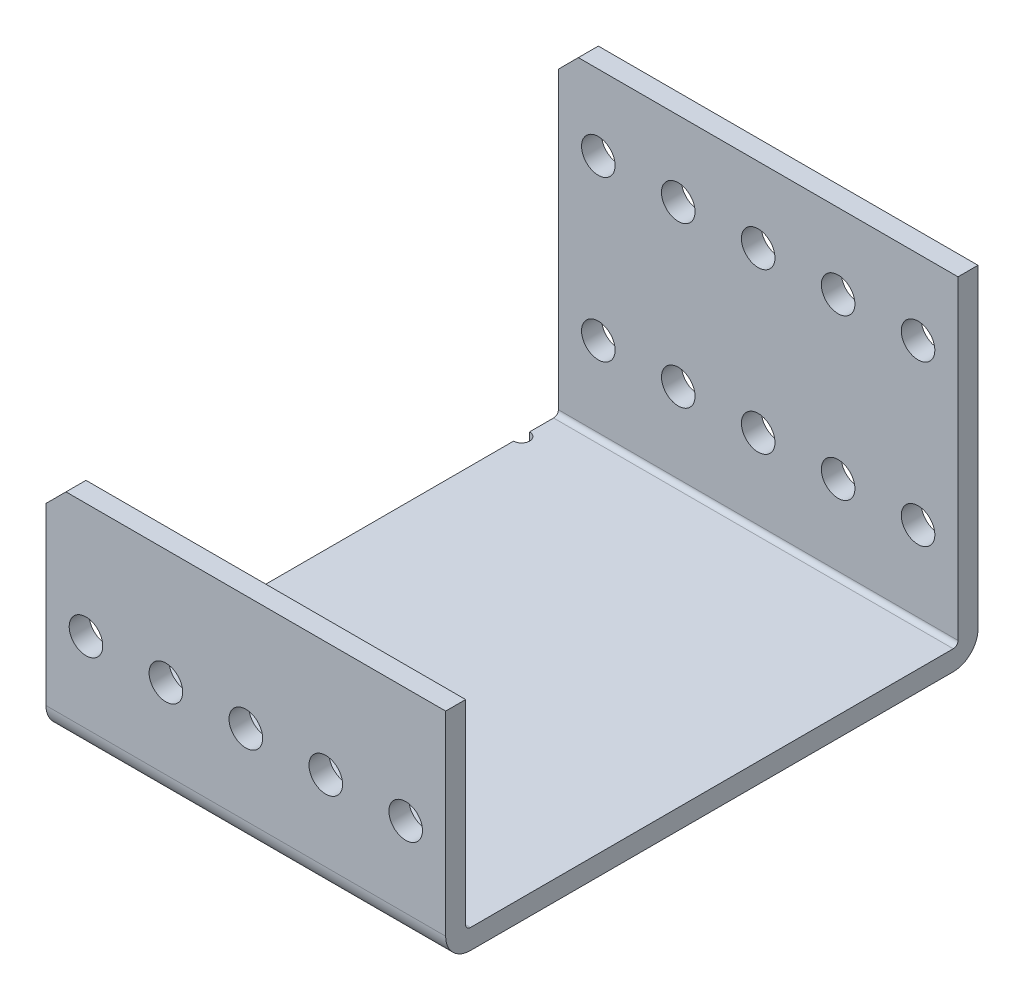
ISO-10303-21;
HEADER;
FILE_DESCRIPTION(('STEP AP214'),'2;1');
FILE_NAME('part.step','',(''),(''),'','','');
FILE_SCHEMA(('AUTOMOTIVE_DESIGN { 1 0 10303 214 1 1 1 1 }'));
ENDSEC;
DATA;
#1=APPLICATION_CONTEXT('core data for automotive mechanical design processes');
#2=APPLICATION_PROTOCOL_DEFINITION('international standard','automotive_design',2000,#1);
#3=PRODUCT_CONTEXT('',#1,'mechanical');
#4=PRODUCT('Part','Part','',(#3));
#5=PRODUCT_RELATED_PRODUCT_CATEGORY('part','',(#4));
#6=PRODUCT_DEFINITION_FORMATION('','',#4);
#7=PRODUCT_DEFINITION_CONTEXT('part definition',#1,'design');
#8=PRODUCT_DEFINITION('design','',#6,#7);
#9=PRODUCT_DEFINITION_SHAPE('','',#8);
#10=(LENGTH_UNIT() NAMED_UNIT(*) SI_UNIT(.MILLI.,.METRE.));
#11=(NAMED_UNIT(*) PLANE_ANGLE_UNIT() SI_UNIT($,.RADIAN.));
#12=(NAMED_UNIT(*) SI_UNIT($,.STERADIAN.) SOLID_ANGLE_UNIT());
#13=UNCERTAINTY_MEASURE_WITH_UNIT(LENGTH_MEASURE(1.E-05),#10,'distance_accuracy_value','');
#14=(GEOMETRIC_REPRESENTATION_CONTEXT(3) GLOBAL_UNCERTAINTY_ASSIGNED_CONTEXT((#13)) GLOBAL_UNIT_ASSIGNED_CONTEXT((#10,
#11,#12)) REPRESENTATION_CONTEXT('',''));
#15=CARTESIAN_POINT('',(0.,0.,0.));
#16=DIRECTION('',(0.,0.,1.));
#17=DIRECTION('',(1.,0.,0.));
#18=AXIS2_PLACEMENT_3D('',#15,#16,#17);
#19=CARTESIAN_POINT('',(-96.1019685333978,22.8913980391147,145.560491578575));
#20=DIRECTION('',(0.,0.,1.));
#21=DIRECTION('',(1.,0.,0.));
#22=AXIS2_PLACEMENT_3D('',#19,#20,#21);
#23=PLANE('',#22);
#24=DIRECTION('',(0.,1.,0.));
#25=VECTOR('',#24,1.);
#26=CARTESIAN_POINT('',(-32.6019685333979,170.358822857148,145.560491578576));
#27=LINE('',#26,#25);
#28=CARTESIAN_POINT('',(-32.6019685333979,26.8283980391147,145.560491578576));
#29=VERTEX_POINT('',#28);
#30=CARTESIAN_POINT('',(-32.6019685333979,57.8163980391021,145.560491578576));
#31=VERTEX_POINT('',#30);
#32=EDGE_CURVE('E209',#29,#31,#27,.T.);
#33=ORIENTED_EDGE('',*,*,#32,.T.);
#34=DIRECTION('',(1.,0.,0.));
#35=VECTOR('',#34,1.);
#36=CARTESIAN_POINT('',(-96.1019685333978,57.8163980391021,145.560491578575));
#37=LINE('',#36,#35);
#38=CARTESIAN_POINT('',(-92.9269685333979,57.8163980391021,145.560491578575));
#39=VERTEX_POINT('',#38);
#40=EDGE_CURVE('E329',#39,#31,#37,.T.);
#41=ORIENTED_EDGE('',*,*,#40,.F.);
#42=DIRECTION('',(0.707106781186535,0.70710678118656,0.));
#43=VECTOR('',#42,1.);
#44=CARTESIAN_POINT('',(-111.976968533392,38.7663980391078,145.560491578575));
#45=LINE('',#44,#43);
#46=CARTESIAN_POINT('',(-96.1019685333978,54.6413980391021,145.560491578575));
#47=VERTEX_POINT('',#46);
#48=EDGE_CURVE('E261',#39,#47,#45,.F.);
#49=ORIENTED_EDGE('',*,*,#48,.T.);
#50=DIRECTION('',(0.,1.,0.));
#51=VECTOR('',#50,1.);
#52=CARTESIAN_POINT('',(-96.1019685333978,22.8913980391147,145.560491578575));
#53=LINE('',#52,#51);
#54=CARTESIAN_POINT('',(-96.1019685333978,26.8283980391147,145.560491578575));
#55=VERTEX_POINT('',#54);
#56=EDGE_CURVE('E322',#55,#47,#53,.T.);
#57=ORIENTED_EDGE('',*,*,#56,.F.);
#58=DIRECTION('',(1.,0.,0.));
#59=VECTOR('',#58,1.);
#60=CARTESIAN_POINT('',(602.398031466602,26.8283980391147,145.560491578575));
#61=LINE('',#60,#59);
#62=EDGE_CURVE('E227',#55,#29,#61,.T.);
#63=ORIENTED_EDGE('',*,*,#62,.T.);
#64=EDGE_LOOP('',(#33,#41,#49,#57,#63));
#65=FACE_BOUND('',#64,.T.);
#66=CARTESIAN_POINT('',(-89.7519685333979,39.5283980391153,145.560491578576));
#67=DIRECTION('',(0.,0.,-1.));
#68=DIRECTION('',(-1.,0.,0.));
#69=AXIS2_PLACEMENT_3D('',#66,#67,#68);
#70=CIRCLE('',#69,2.667);
#71=CARTESIAN_POINT('',(-92.4189685333979,39.5283980391153,145.560491578576));
#72=VERTEX_POINT('',#71);
#73=EDGE_CURVE('E309',#72,#72,#70,.T.);
#74=ORIENTED_EDGE('',*,*,#73,.T.);
#75=EDGE_LOOP('',(#74));
#76=FACE_BOUND('',#75,.T.);
#77=CARTESIAN_POINT('',(-77.0519685333979,39.5283980391153,145.560491578576));
#78=DIRECTION('',(0.,0.,-1.));
#79=DIRECTION('',(-1.,0.,0.));
#80=AXIS2_PLACEMENT_3D('',#77,#78,#79);
#81=CIRCLE('',#80,2.667);
#82=CARTESIAN_POINT('',(-79.7189685333979,39.5283980391153,145.560491578576));
#83=VERTEX_POINT('',#82);
#84=EDGE_CURVE('E303',#83,#83,#81,.T.);
#85=ORIENTED_EDGE('',*,*,#84,.T.);
#86=EDGE_LOOP('',(#85));
#87=FACE_BOUND('',#86,.T.);
#88=CARTESIAN_POINT('',(-64.351968533398,39.5283980391153,145.560491578576));
#89=DIRECTION('',(0.,0.,-1.));
#90=DIRECTION('',(-1.,0.,0.));
#91=AXIS2_PLACEMENT_3D('',#88,#89,#90);
#92=CIRCLE('',#91,2.667);
#93=CARTESIAN_POINT('',(-67.018968533398,39.5283980391153,145.560491578576));
#94=VERTEX_POINT('',#93);
#95=EDGE_CURVE('E297',#94,#94,#92,.T.);
#96=ORIENTED_EDGE('',*,*,#95,.T.);
#97=EDGE_LOOP('',(#96));
#98=FACE_BOUND('',#97,.T.);
#99=CARTESIAN_POINT('',(-51.6519685333979,39.5283980391153,145.560491578576));
#100=DIRECTION('',(0.,0.,-1.));
#101=DIRECTION('',(-1.,0.,0.));
#102=AXIS2_PLACEMENT_3D('',#99,#100,#101);
#103=CIRCLE('',#102,2.667);
#104=CARTESIAN_POINT('',(-54.3189685333979,39.5283980391153,145.560491578576));
#105=VERTEX_POINT('',#104);
#106=EDGE_CURVE('E291',#105,#105,#103,.T.);
#107=ORIENTED_EDGE('',*,*,#106,.T.);
#108=EDGE_LOOP('',(#107));
#109=FACE_BOUND('',#108,.T.);
#110=CARTESIAN_POINT('',(-38.9519685333979,39.5283980391153,145.560491578576));
#111=DIRECTION('',(0.,0.,-1.));
#112=DIRECTION('',(-1.,0.,0.));
#113=AXIS2_PLACEMENT_3D('',#110,#111,#112);
#114=CIRCLE('',#113,2.667);
#115=CARTESIAN_POINT('',(-41.6189685333979,39.5283980391153,145.560491578576));
#116=VERTEX_POINT('',#115);
#117=EDGE_CURVE('E285',#116,#116,#114,.T.);
#118=ORIENTED_EDGE('',*,*,#117,.T.);
#119=EDGE_LOOP('',(#118));
#120=FACE_BOUND('',#119,.T.);
#121=ADVANCED_FACE('F38',(#65,#76,#87,#98,#109,#120),#23,.T.);
#122=CARTESIAN_POINT('',(-96.101968533398,22.8913980391147,60.9784915785786));
#123=DIRECTION('',(-1.,0.,0.));
#124=DIRECTION('',(0.,0.,1.));
#125=AXIS2_PLACEMENT_3D('',#122,#123,#124);
#126=PLANE('',#125);
#127=DIRECTION('',(0.,0.,1.));
#128=VECTOR('',#127,1.);
#129=CARTESIAN_POINT('',(-96.101968533398,22.8913980391147,60.9784915785786));
#130=LINE('',#129,#128);
#131=CARTESIAN_POINT('',(-96.1019685333979,22.8913980391147,137.813491578575));
#132=VERTEX_POINT('',#131);
#133=CARTESIAN_POINT('',(-96.1019685333978,22.8913980391147,141.623491578575));
#134=VERTEX_POINT('',#133);
#135=EDGE_CURVE('E333',#132,#134,#130,.T.);
#136=ORIENTED_EDGE('',*,*,#135,.T.);
#137=CARTESIAN_POINT('',(-96.1019685333978,26.8283980391147,141.623491578575));
#138=DIRECTION('',(-1.,0.,0.));
#139=DIRECTION('',(0.,0.,1.));
#140=AXIS2_PLACEMENT_3D('',#137,#138,#139);
#141=CIRCLE('',#140,3.937);
#142=EDGE_CURVE('E213',#134,#55,#141,.T.);
#143=ORIENTED_EDGE('',*,*,#142,.T.);
#144=ORIENTED_EDGE('',*,*,#56,.T.);
#145=DIRECTION('',(0.,0.,-1.));
#146=VECTOR('',#145,1.);
#147=CARTESIAN_POINT('',(-96.101968533398,54.6413980391021,60.9784915785786));
#148=LINE('',#147,#146);
#149=CARTESIAN_POINT('',(-96.1019685333979,54.6413980391021,142.385491578578));
#150=VERTEX_POINT('',#149);
#151=EDGE_CURVE('E258',#47,#150,#148,.T.);
#152=ORIENTED_EDGE('',*,*,#151,.T.);
#153=DIRECTION('',(0.,-1.,0.));
#154=VECTOR('',#153,1.);
#155=CARTESIAN_POINT('',(-96.1019685333979,57.8163980391014,142.385491578578));
#156=LINE('',#155,#154);
#157=CARTESIAN_POINT('',(-96.1019685333979,26.828398039114,142.385491578578));
#158=VERTEX_POINT('',#157);
#159=EDGE_CURVE('E346',#150,#158,#156,.T.);
#160=ORIENTED_EDGE('',*,*,#159,.T.);
#161=CARTESIAN_POINT('',(-96.1019685333978,26.828398039114,141.623491578578));
#162=DIRECTION('',(-1.,0.,0.));
#163=DIRECTION('',(0.,0.,1.));
#164=AXIS2_PLACEMENT_3D('',#161,#162,#163);
#165=CIRCLE('',#164,0.761999999999985);
#166=CARTESIAN_POINT('',(-96.1019685333979,26.066398039114,141.623491578578));
#167=VERTEX_POINT('',#166);
#168=EDGE_CURVE('E231',#158,#167,#165,.F.);
#169=ORIENTED_EDGE('',*,*,#168,.T.);
#170=DIRECTION('',(0.,0.,-1.));
#171=VECTOR('',#170,1.);
#172=CARTESIAN_POINT('',(-96.1019685333979,26.066398039114,142.385491578578));
#173=LINE('',#172,#171);
#174=CARTESIAN_POINT('',(-96.1019685333979,26.066398039114,137.813491578575));
#175=VERTEX_POINT('',#174);
#176=EDGE_CURVE('E341',#167,#175,#173,.T.);
#177=ORIENTED_EDGE('',*,*,#176,.T.);
#178=DIRECTION('',(0.,1.,0.));
#179=VECTOR('',#178,1.);
#180=CARTESIAN_POINT('',(-96.1019685333979,26.066398039114,137.813491578575));
#181=LINE('',#180,#179);
#182=EDGE_CURVE('E367',#132,#175,#181,.T.);
#183=ORIENTED_EDGE('',*,*,#182,.F.);
#184=EDGE_LOOP('',(#136,#143,#144,#152,#160,#169,#177,#183));
#185=FACE_BOUND('',#184,.T.);
#186=ADVANCED_FACE('F549',(#185),#126,.T.);
#187=DIRECTION('',(0.,1.,0.));
#188=VECTOR('',#187,1.);
#189=CARTESIAN_POINT('',(-96.1019685333979,26.066398039114,135.273491578575));
#190=LINE('',#189,#188);
#191=CARTESIAN_POINT('',(-96.1019685333979,26.066398039114,135.273491578575));
#192=VERTEX_POINT('',#191);
#193=CARTESIAN_POINT('',(-96.1019685333979,22.8913980391147,135.273491578575));
#194=VERTEX_POINT('',#193);
#195=EDGE_CURVE('E371',#192,#194,#190,.F.);
#196=ORIENTED_EDGE('',*,*,#195,.F.);
#197=CARTESIAN_POINT('',(-96.1019685333979,26.0663980391139,71.2654915785778));
#198=VERTEX_POINT('',#197);
#199=EDGE_CURVE('E344',#192,#198,#173,.T.);
#200=ORIENTED_EDGE('',*,*,#199,.T.);
#201=DIRECTION('',(0.,1.,0.));
#202=VECTOR('',#201,1.);
#203=CARTESIAN_POINT('',(-96.1019685333979,26.0663980391139,71.2654915785778));
#204=LINE('',#203,#202);
#205=CARTESIAN_POINT('',(-96.1019685333979,22.8913980391146,71.2654915785778));
#206=VERTEX_POINT('',#205);
#207=EDGE_CURVE('E279',#206,#198,#204,.T.);
#208=ORIENTED_EDGE('',*,*,#207,.F.);
#209=EDGE_CURVE('E337',#206,#194,#130,.T.);
#210=ORIENTED_EDGE('',*,*,#209,.T.);
#211=EDGE_LOOP('',(#196,#200,#208,#210));
#212=FACE_BOUND('',#211,.T.);
#213=ADVANCED_FACE('F542',(#212),#126,.T.);
#214=CARTESIAN_POINT('',(-96.1019685333979,26.066398039114,142.385491578578));
#215=DIRECTION('',(0.,-1.,0.));
#216=DIRECTION('',(0.,0.,-1.));
#217=AXIS2_PLACEMENT_3D('',#214,#215,#216);
#218=PLANE('',#217);
#219=DIRECTION('',(1.,0.,0.));
#220=VECTOR('',#219,1.);
#221=CARTESIAN_POINT('',(602.398031466603,26.066398039114,141.623491578577));
#222=LINE('',#221,#220);
#223=CARTESIAN_POINT('',(-32.6019685333979,26.066398039114,141.623491578578));
#224=VERTEX_POINT('',#223);
#225=EDGE_CURVE('E243',#167,#224,#222,.T.);
#226=ORIENTED_EDGE('',*,*,#225,.T.);
#227=DIRECTION('',(0.,0.,-1.));
#228=VECTOR('',#227,1.);
#229=CARTESIAN_POINT('',(-32.6019685333979,26.066398039114,142.385491578578));
#230=LINE('',#229,#228);
#231=CARTESIAN_POINT('',(-32.6019685333979,26.0663980391139,64.9154915785779));
#232=VERTEX_POINT('',#231);
#233=EDGE_CURVE('E475',#224,#232,#230,.T.);
#234=ORIENTED_EDGE('',*,*,#233,.T.);
#235=DIRECTION('',(1.,0.,0.));
#236=VECTOR('',#235,1.);
#237=CARTESIAN_POINT('',(-96.1019685333979,26.0663980391139,64.9154915785779));
#238=LINE('',#237,#236);
#239=CARTESIAN_POINT('',(-96.1019685333981,26.0663980391139,64.9154915785779));
#240=VERTEX_POINT('',#239);
#241=EDGE_CURVE('E240',#232,#240,#238,.F.);
#242=ORIENTED_EDGE('',*,*,#241,.T.);
#243=CARTESIAN_POINT('',(-96.1019685333981,26.0663980391139,68.7254915785778));
#244=VERTEX_POINT('',#243);
#245=EDGE_CURVE('E345',#244,#240,#173,.T.);
#246=ORIENTED_EDGE('',*,*,#245,.F.);
#247=CARTESIAN_POINT('',(-96.1019685333979,26.0663980391139,69.9954915785778));
#248=DIRECTION('',(0.,1.,0.));
#249=DIRECTION('',(0.,0.,1.));
#250=AXIS2_PLACEMENT_3D('',#247,#248,#249);
#251=CIRCLE('',#250,1.26999999999998);
#252=EDGE_CURVE('E364',#198,#244,#251,.T.);
#253=ORIENTED_EDGE('',*,*,#252,.F.);
#254=ORIENTED_EDGE('',*,*,#199,.F.);
#255=CARTESIAN_POINT('',(-96.1019685333979,26.066398039114,136.543491578575));
#256=DIRECTION('',(0.,1.,0.));
#257=DIRECTION('',(0.,0.,1.));
#258=AXIS2_PLACEMENT_3D('',#255,#256,#257);
#259=CIRCLE('',#258,1.26999999999998);
#260=EDGE_CURVE('E378',#175,#192,#259,.T.);
#261=ORIENTED_EDGE('',*,*,#260,.F.);
#262=ORIENTED_EDGE('',*,*,#176,.F.);
#263=EDGE_LOOP('',(#226,#234,#242,#246,#253,#254,#261,#262));
#264=FACE_BOUND('',#263,.T.);
#265=ADVANCED_FACE('F534',(#264),#218,.F.);
#266=DIRECTION('',(0.,1.,0.));
#267=VECTOR('',#266,1.);
#268=CARTESIAN_POINT('',(-96.101968533398,22.8913980391147,60.9784915785786));
#269=LINE('',#268,#267);
#270=CARTESIAN_POINT('',(-96.101968533398,26.8283980391147,60.9784915785786));
#271=VERTEX_POINT('',#270);
#272=CARTESIAN_POINT('',(-96.101968533398,73.6913980391152,60.9784915785786));
#273=VERTEX_POINT('',#272);
#274=EDGE_CURVE('E323',#271,#273,#269,.T.);
#275=ORIENTED_EDGE('',*,*,#274,.F.);
#276=CARTESIAN_POINT('',(-96.1019685333979,26.8283980391147,64.9154915785786));
#277=DIRECTION('',(-1.,0.,0.));
#278=DIRECTION('',(0.,0.,1.));
#279=AXIS2_PLACEMENT_3D('',#276,#277,#278);
#280=CIRCLE('',#279,3.937);
#281=CARTESIAN_POINT('',(-96.101968533398,22.8913980391147,64.9154915785786));
#282=VERTEX_POINT('',#281);
#283=EDGE_CURVE('E47',#271,#282,#280,.T.);
#284=ORIENTED_EDGE('',*,*,#283,.T.);
#285=CARTESIAN_POINT('',(-96.1019685333979,22.8913980391146,68.7254915785778));
#286=VERTEX_POINT('',#285);
#287=EDGE_CURVE('E326',#282,#286,#130,.T.);
#288=ORIENTED_EDGE('',*,*,#287,.T.);
#289=DIRECTION('',(0.,1.,0.));
#290=VECTOR('',#289,1.);
#291=CARTESIAN_POINT('',(-96.1019685333979,26.0663980391139,68.7254915785778));
#292=LINE('',#291,#290);
#293=EDGE_CURVE('E318',#244,#286,#292,.F.);
#294=ORIENTED_EDGE('',*,*,#293,.F.);
#295=ORIENTED_EDGE('',*,*,#245,.T.);
#296=CARTESIAN_POINT('',(-96.1019685333979,26.8283980391139,64.9154915785779));
#297=DIRECTION('',(-1.,0.,0.));
#298=DIRECTION('',(0.,0.,1.));
#299=AXIS2_PLACEMENT_3D('',#296,#297,#298);
#300=CIRCLE('',#299,0.761999999999985);
#301=CARTESIAN_POINT('',(-96.1019685333979,26.8283980391139,64.1534915785779));
#302=VERTEX_POINT('',#301);
#303=EDGE_CURVE('E234',#240,#302,#300,.F.);
#304=ORIENTED_EDGE('',*,*,#303,.T.);
#305=DIRECTION('',(0.,-1.,0.));
#306=VECTOR('',#305,1.);
#307=CARTESIAN_POINT('',(-96.1019685333979,76.8663980391153,64.1534915785778));
#308=LINE('',#307,#306);
#309=CARTESIAN_POINT('',(-96.1019685333979,73.6913980391152,64.1534915785778));
#310=VERTEX_POINT('',#309);
#311=EDGE_CURVE('E350',#310,#302,#308,.T.);
#312=ORIENTED_EDGE('',*,*,#311,.F.);
#313=DIRECTION('',(0.,0.,-1.));
#314=VECTOR('',#313,1.);
#315=CARTESIAN_POINT('',(-96.101968533398,73.6913980391152,60.9784915785779));
#316=LINE('',#315,#314);
#317=EDGE_CURVE('E251',#310,#273,#316,.T.);
#318=ORIENTED_EDGE('',*,*,#317,.T.);
#319=EDGE_LOOP('',(#275,#284,#288,#294,#295,#304,#312,#318));
#320=FACE_BOUND('',#319,.T.);
#321=ADVANCED_FACE('F525',(#320),#126,.T.);
#322=CARTESIAN_POINT('',(602.398031466602,22.8913980391147,60.9784915785785));
#323=DIRECTION('',(0.,0.,-1.));
#324=DIRECTION('',(-1.,0.,0.));
#325=AXIS2_PLACEMENT_3D('',#322,#323,#324);
#326=PLANE('',#325);
#327=DIRECTION('',(0.,1.,0.));
#328=VECTOR('',#327,1.);
#329=CARTESIAN_POINT('',(-32.6019685333979,170.358822857148,60.9784915785786));
#330=LINE('',#329,#328);
#331=CARTESIAN_POINT('',(-32.6019685333979,26.8283980391147,60.9784915785786));
#332=VERTEX_POINT('',#331);
#333=CARTESIAN_POINT('',(-32.6019685333979,76.8663980391153,60.9784915785786));
#334=VERTEX_POINT('',#333);
#335=EDGE_CURVE('E198',#332,#334,#330,.T.);
#336=ORIENTED_EDGE('',*,*,#335,.F.);
#337=DIRECTION('',(-1.,0.,0.));
#338=VECTOR('',#337,1.);
#339=CARTESIAN_POINT('',(-96.1019685333979,26.8283980391147,60.9784915785786));
#340=LINE('',#339,#338);
#341=EDGE_CURVE('E65',#332,#271,#340,.T.);
#342=ORIENTED_EDGE('',*,*,#341,.T.);
#343=ORIENTED_EDGE('',*,*,#274,.T.);
#344=DIRECTION('',(0.707106781186535,0.70710678118656,0.));
#345=VECTOR('',#344,1.);
#346=CARTESIAN_POINT('',(227.74803146659,397.541398039114,60.9784915785785));
#347=LINE('',#346,#345);
#348=CARTESIAN_POINT('',(-92.9269685333979,76.8663980391153,60.9784915785779));
#349=VERTEX_POINT('',#348);
#350=EDGE_CURVE('E272',#273,#349,#347,.T.);
#351=ORIENTED_EDGE('',*,*,#350,.T.);
#352=DIRECTION('',(-1.,0.,0.));
#353=VECTOR('',#352,1.);
#354=CARTESIAN_POINT('',(-96.1019685333979,76.8663980391153,60.9784915785779));
#355=LINE('',#354,#353);
#356=EDGE_CURVE('E207',#334,#349,#355,.T.);
#357=ORIENTED_EDGE('',*,*,#356,.F.);
#358=EDGE_LOOP('',(#336,#342,#343,#351,#357));
#359=FACE_BOUND('',#358,.T.);
#360=CARTESIAN_POINT('',(-38.9519685333979,39.5283980391153,60.9784915785786));
#361=DIRECTION('',(0.,0.,-1.));
#362=DIRECTION('',(-1.,0.,0.));
#363=AXIS2_PLACEMENT_3D('',#360,#361,#362);
#364=CIRCLE('',#363,2.667);
#365=CARTESIAN_POINT('',(-41.6189685333979,39.5283980391153,60.9784915785786));
#366=VERTEX_POINT('',#365);
#367=EDGE_CURVE('E460',#366,#366,#364,.T.);
#368=ORIENTED_EDGE('',*,*,#367,.F.);
#369=EDGE_LOOP('',(#368));
#370=FACE_BOUND('',#369,.T.);
#371=CARTESIAN_POINT('',(-51.6519685333979,39.5283980391153,60.9784915785786));
#372=DIRECTION('',(0.,0.,-1.));
#373=DIRECTION('',(-1.,0.,0.));
#374=AXIS2_PLACEMENT_3D('',#371,#372,#373);
#375=CIRCLE('',#374,2.667);
#376=CARTESIAN_POINT('',(-54.3189685333979,39.5283980391153,60.9784915785786));
#377=VERTEX_POINT('',#376);
#378=EDGE_CURVE('E451',#377,#377,#375,.T.);
#379=ORIENTED_EDGE('',*,*,#378,.F.);
#380=EDGE_LOOP('',(#379));
#381=FACE_BOUND('',#380,.T.);
#382=CARTESIAN_POINT('',(-64.351968533398,39.5283980391153,60.9784915785787));
#383=DIRECTION('',(0.,0.,-1.));
#384=DIRECTION('',(-1.,0.,0.));
#385=AXIS2_PLACEMENT_3D('',#382,#383,#384);
#386=CIRCLE('',#385,2.667);
#387=CARTESIAN_POINT('',(-67.018968533398,39.5283980391153,60.9784915785787));
#388=VERTEX_POINT('',#387);
#389=EDGE_CURVE('E441',#388,#388,#386,.T.);
#390=ORIENTED_EDGE('',*,*,#389,.F.);
#391=EDGE_LOOP('',(#390));
#392=FACE_BOUND('',#391,.T.);
#393=CARTESIAN_POINT('',(-77.0519685333979,39.5283980391153,60.9784915785787));
#394=DIRECTION('',(0.,0.,-1.));
#395=DIRECTION('',(-1.,0.,0.));
#396=AXIS2_PLACEMENT_3D('',#393,#394,#395);
#397=CIRCLE('',#396,2.667);
#398=CARTESIAN_POINT('',(-79.7189685333979,39.5283980391153,60.9784915785787));
#399=VERTEX_POINT('',#398);
#400=EDGE_CURVE('E431',#399,#399,#397,.T.);
#401=ORIENTED_EDGE('',*,*,#400,.F.);
#402=EDGE_LOOP('',(#401));
#403=FACE_BOUND('',#402,.T.);
#404=CARTESIAN_POINT('',(-89.7519685333979,39.5283980391153,60.9784915785787));
#405=DIRECTION('',(0.,0.,-1.));
#406=DIRECTION('',(-1.,0.,0.));
#407=AXIS2_PLACEMENT_3D('',#404,#405,#406);
#408=CIRCLE('',#407,2.667);
#409=CARTESIAN_POINT('',(-92.4189685333979,39.5283980391153,60.9784915785787));
#410=VERTEX_POINT('',#409);
#411=EDGE_CURVE('E421',#410,#410,#408,.T.);
#412=ORIENTED_EDGE('',*,*,#411,.F.);
#413=EDGE_LOOP('',(#412));
#414=FACE_BOUND('',#413,.T.);
#415=CARTESIAN_POINT('',(-38.9519685333979,64.9283980391154,60.9784915785786));
#416=DIRECTION('',(0.,0.,-1.));
#417=DIRECTION('',(-1.,0.,0.));
#418=AXIS2_PLACEMENT_3D('',#415,#416,#417);
#419=CIRCLE('',#418,2.667);
#420=CARTESIAN_POINT('',(-41.6189685333979,64.9283980391154,60.9784915785786));
#421=VERTEX_POINT('',#420);
#422=EDGE_CURVE('E411',#421,#421,#419,.T.);
#423=ORIENTED_EDGE('',*,*,#422,.F.);
#424=EDGE_LOOP('',(#423));
#425=FACE_BOUND('',#424,.T.);
#426=CARTESIAN_POINT('',(-51.6519685333979,64.9283980391154,60.9784915785786));
#427=DIRECTION('',(0.,0.,-1.));
#428=DIRECTION('',(-1.,0.,0.));
#429=AXIS2_PLACEMENT_3D('',#426,#427,#428);
#430=CIRCLE('',#429,2.667);
#431=CARTESIAN_POINT('',(-54.3189685333979,64.9283980391154,60.9784915785786));
#432=VERTEX_POINT('',#431);
#433=EDGE_CURVE('E314',#432,#432,#430,.T.);
#434=ORIENTED_EDGE('',*,*,#433,.F.);
#435=EDGE_LOOP('',(#434));
#436=FACE_BOUND('',#435,.T.);
#437=CARTESIAN_POINT('',(-64.351968533398,64.9283980391154,60.9784915785787));
#438=DIRECTION('',(0.,0.,-1.));
#439=DIRECTION('',(-1.,0.,0.));
#440=AXIS2_PLACEMENT_3D('',#437,#438,#439);
#441=CIRCLE('',#440,2.667);
#442=CARTESIAN_POINT('',(-67.018968533398,64.9283980391154,60.9784915785787));
#443=VERTEX_POINT('',#442);
#444=EDGE_CURVE('E313',#443,#443,#441,.T.);
#445=ORIENTED_EDGE('',*,*,#444,.F.);
#446=EDGE_LOOP('',(#445));
#447=FACE_BOUND('',#446,.T.);
#448=CARTESIAN_POINT('',(-77.051968533398,64.9283980391154,60.9784915785787));
#449=DIRECTION('',(0.,0.,-1.));
#450=DIRECTION('',(-1.,0.,0.));
#451=AXIS2_PLACEMENT_3D('',#448,#449,#450);
#452=CIRCLE('',#451,2.667);
#453=CARTESIAN_POINT('',(-79.718968533398,64.9283980391154,60.9784915785787));
#454=VERTEX_POINT('',#453);
#455=EDGE_CURVE('E393',#454,#454,#452,.T.);
#456=ORIENTED_EDGE('',*,*,#455,.F.);
#457=EDGE_LOOP('',(#456));
#458=FACE_BOUND('',#457,.T.);
#459=CARTESIAN_POINT('',(-89.7519685333979,64.9283980391154,60.9784915785787));
#460=DIRECTION('',(0.,0.,-1.));
#461=DIRECTION('',(-1.,0.,0.));
#462=AXIS2_PLACEMENT_3D('',#459,#460,#461);
#463=CIRCLE('',#462,2.667);
#464=CARTESIAN_POINT('',(-92.4189685333979,64.9283980391154,60.9784915785787));
#465=VERTEX_POINT('',#464);
#466=EDGE_CURVE('E385',#465,#465,#463,.T.);
#467=ORIENTED_EDGE('',*,*,#466,.F.);
#468=EDGE_LOOP('',(#467));
#469=FACE_BOUND('',#468,.T.);
#470=ADVANCED_FACE('F204',(#359,#370,#381,#392,#403,#414,#425,#436,#447,#458,#469),#326,.T.);
#471=CARTESIAN_POINT('',(0.,22.8913980391147,0.));
#472=DIRECTION('',(0.,1.,0.));
#473=DIRECTION('',(0.,0.,1.));
#474=AXIS2_PLACEMENT_3D('',#471,#472,#473);
#475=PLANE('',#474);
#476=DIRECTION('',(-1.,0.,0.));
#477=VECTOR('',#476,1.);
#478=CARTESIAN_POINT('',(602.398031466602,22.8913980391147,64.9154915785785));
#479=LINE('',#478,#477);
#480=CARTESIAN_POINT('',(-32.6019685333979,22.8913980391147,64.9154915785786));
#481=VERTEX_POINT('',#480);
#482=EDGE_CURVE('E224',#282,#481,#479,.F.);
#483=ORIENTED_EDGE('',*,*,#482,.T.);
#484=DIRECTION('',(0.,0.,1.));
#485=VECTOR('',#484,1.);
#486=CARTESIAN_POINT('',(-32.6019685333979,22.8913980391147,0.));
#487=LINE('',#486,#485);
#488=CARTESIAN_POINT('',(-32.6019685333979,22.8913980391147,141.623491578575));
#489=VERTEX_POINT('',#488);
#490=EDGE_CURVE('E56',#481,#489,#487,.T.);
#491=ORIENTED_EDGE('',*,*,#490,.T.);
#492=DIRECTION('',(1.,0.,0.));
#493=VECTOR('',#492,1.);
#494=CARTESIAN_POINT('',(-96.1019685333978,22.8913980391147,141.623491578575));
#495=LINE('',#494,#493);
#496=EDGE_CURVE('E219',#489,#134,#495,.F.);
#497=ORIENTED_EDGE('',*,*,#496,.T.);
#498=ORIENTED_EDGE('',*,*,#135,.F.);
#499=CARTESIAN_POINT('',(-96.1019685333979,22.8913980391147,136.543491578575));
#500=DIRECTION('',(0.,1.,0.));
#501=DIRECTION('',(0.,0.,1.));
#502=AXIS2_PLACEMENT_3D('',#499,#500,#501);
#503=CIRCLE('',#502,1.26999999999999);
#504=EDGE_CURVE('E374',#132,#194,#503,.T.);
#505=ORIENTED_EDGE('',*,*,#504,.T.);
#506=ORIENTED_EDGE('',*,*,#209,.F.);
#507=CARTESIAN_POINT('',(-96.1019685333979,22.8913980391146,69.9954915785778));
#508=DIRECTION('',(0.,1.,0.));
#509=DIRECTION('',(0.,0.,1.));
#510=AXIS2_PLACEMENT_3D('',#507,#508,#509);
#511=CIRCLE('',#510,1.26999999999999);
#512=EDGE_CURVE('E360',#206,#286,#511,.T.);
#513=ORIENTED_EDGE('',*,*,#512,.T.);
#514=ORIENTED_EDGE('',*,*,#287,.F.);
#515=EDGE_LOOP('',(#483,#491,#497,#498,#505,#506,#513,#514));
#516=FACE_BOUND('',#515,.T.);
#517=ADVANCED_FACE('F518',(#516),#475,.F.);
#518=CARTESIAN_POINT('',(0.,57.8163980391021,0.));
#519=DIRECTION('',(0.,1.,0.));
#520=DIRECTION('',(0.,0.,1.));
#521=AXIS2_PLACEMENT_3D('',#518,#519,#520);
#522=PLANE('',#521);
#523=DIRECTION('',(0.,0.,1.));
#524=VECTOR('',#523,1.);
#525=CARTESIAN_POINT('',(-32.6019685333979,57.8163980391021,0.));
#526=LINE('',#525,#524);
#527=CARTESIAN_POINT('',(-32.6019685333979,57.8163980391014,142.385491578578));
#528=VERTEX_POINT('',#527);
#529=EDGE_CURVE('E479',#528,#31,#526,.T.);
#530=ORIENTED_EDGE('',*,*,#529,.F.);
#531=DIRECTION('',(1.,0.,0.));
#532=VECTOR('',#531,1.);
#533=CARTESIAN_POINT('',(-96.1019685333979,57.8163980391014,142.385491578578));
#534=LINE('',#533,#532);
#535=CARTESIAN_POINT('',(-92.9269685333979,57.8163980391014,142.385491578578));
#536=VERTEX_POINT('',#535);
#537=EDGE_CURVE('E334',#536,#528,#534,.T.);
#538=ORIENTED_EDGE('',*,*,#537,.F.);
#539=DIRECTION('',(0.,0.,1.));
#540=VECTOR('',#539,1.);
#541=CARTESIAN_POINT('',(-92.9269685333981,57.8163980391021,1.21975905126859E-13));
#542=LINE('',#541,#540);
#543=EDGE_CURVE('E265',#536,#39,#542,.T.);
#544=ORIENTED_EDGE('',*,*,#543,.T.);
#545=ORIENTED_EDGE('',*,*,#40,.T.);
#546=EDGE_LOOP('',(#530,#538,#544,#545));
#547=FACE_BOUND('',#546,.T.);
#548=ADVANCED_FACE('F505',(#547),#522,.T.);
#549=CARTESIAN_POINT('',(-96.1019685333979,57.8163980391014,142.385491578578));
#550=DIRECTION('',(0.,0.,1.));
#551=DIRECTION('',(1.,0.,0.));
#552=AXIS2_PLACEMENT_3D('',#549,#550,#551);
#553=PLANE('',#552);
#554=CARTESIAN_POINT('',(-38.9519685333979,39.5283980391153,142.385491578578));
#555=DIRECTION('',(0.,0.,1.));
#556=DIRECTION('',(1.,0.,0.));
#557=AXIS2_PLACEMENT_3D('',#554,#555,#556);
#558=CIRCLE('',#557,2.667);
#559=CARTESIAN_POINT('',(-36.2849685333979,39.5283980391153,142.385491578578));
#560=VERTEX_POINT('',#559);
#561=EDGE_CURVE('E284',#560,#560,#558,.T.);
#562=ORIENTED_EDGE('',*,*,#561,.T.);
#563=EDGE_LOOP('',(#562));
#564=FACE_BOUND('',#563,.T.);
#565=CARTESIAN_POINT('',(-51.6519685333979,39.5283980391153,142.385491578578));
#566=DIRECTION('',(0.,0.,1.));
#567=DIRECTION('',(1.,0.,0.));
#568=AXIS2_PLACEMENT_3D('',#565,#566,#567);
#569=CIRCLE('',#568,2.667);
#570=CARTESIAN_POINT('',(-48.9849685333979,39.5283980391153,142.385491578578));
#571=VERTEX_POINT('',#570);
#572=EDGE_CURVE('E290',#571,#571,#569,.T.);
#573=ORIENTED_EDGE('',*,*,#572,.T.);
#574=EDGE_LOOP('',(#573));
#575=FACE_BOUND('',#574,.T.);
#576=CARTESIAN_POINT('',(-64.351968533398,39.5283980391153,142.385491578578));
#577=DIRECTION('',(0.,0.,1.));
#578=DIRECTION('',(1.,0.,0.));
#579=AXIS2_PLACEMENT_3D('',#576,#577,#578);
#580=CIRCLE('',#579,2.667);
#581=CARTESIAN_POINT('',(-61.684968533398,39.5283980391153,142.385491578578));
#582=VERTEX_POINT('',#581);
#583=EDGE_CURVE('E296',#582,#582,#580,.T.);
#584=ORIENTED_EDGE('',*,*,#583,.T.);
#585=EDGE_LOOP('',(#584));
#586=FACE_BOUND('',#585,.T.);
#587=CARTESIAN_POINT('',(-77.0519685333979,39.5283980391153,142.385491578578));
#588=DIRECTION('',(0.,0.,1.));
#589=DIRECTION('',(1.,0.,0.));
#590=AXIS2_PLACEMENT_3D('',#587,#588,#589);
#591=CIRCLE('',#590,2.667);
#592=CARTESIAN_POINT('',(-74.3849685333979,39.5283980391153,142.385491578578));
#593=VERTEX_POINT('',#592);
#594=EDGE_CURVE('E302',#593,#593,#591,.T.);
#595=ORIENTED_EDGE('',*,*,#594,.T.);
#596=EDGE_LOOP('',(#595));
#597=FACE_BOUND('',#596,.T.);
#598=CARTESIAN_POINT('',(-89.7519685333979,39.5283980391153,142.385491578578));
#599=DIRECTION('',(0.,0.,1.));
#600=DIRECTION('',(1.,0.,0.));
#601=AXIS2_PLACEMENT_3D('',#598,#599,#600);
#602=CIRCLE('',#601,2.667);
#603=CARTESIAN_POINT('',(-87.0849685333979,39.5283980391153,142.385491578578));
#604=VERTEX_POINT('',#603);
#605=EDGE_CURVE('E308',#604,#604,#602,.T.);
#606=ORIENTED_EDGE('',*,*,#605,.T.);
#607=EDGE_LOOP('',(#606));
#608=FACE_BOUND('',#607,.T.);
#609=ORIENTED_EDGE('',*,*,#537,.T.);
#610=DIRECTION('',(0.,-1.,0.));
#611=VECTOR('',#610,1.);
#612=CARTESIAN_POINT('',(-32.6019685333979,57.8163980391014,142.385491578578));
#613=LINE('',#612,#611);
#614=CARTESIAN_POINT('',(-32.6019685333979,26.828398039114,142.385491578578));
#615=VERTEX_POINT('',#614);
#616=EDGE_CURVE('E482',#528,#615,#613,.T.);
#617=ORIENTED_EDGE('',*,*,#616,.T.);
#618=DIRECTION('',(1.,0.,0.));
#619=VECTOR('',#618,1.);
#620=CARTESIAN_POINT('',(-96.1019685333979,26.828398039114,142.385491578578));
#621=LINE('',#620,#619);
#622=EDGE_CURVE('E237',#615,#158,#621,.F.);
#623=ORIENTED_EDGE('',*,*,#622,.T.);
#624=ORIENTED_EDGE('',*,*,#159,.F.);
#625=DIRECTION('',(-0.707106781186535,-0.70710678118656,0.));
#626=VECTOR('',#625,1.);
#627=CARTESIAN_POINT('',(-92.9269685333977,57.8163980391023,142.385491578578));
#628=LINE('',#627,#626);
#629=EDGE_CURVE('E255',#150,#536,#628,.F.);
#630=ORIENTED_EDGE('',*,*,#629,.T.);
#631=EDGE_LOOP('',(#609,#617,#623,#624,#630));
#632=FACE_BOUND('',#631,.T.);
#633=ADVANCED_FACE('F557',(#564,#575,#586,#597,#608,#632),#553,.F.);
#634=CARTESIAN_POINT('',(602.398031466603,76.8663980391153,64.1534915785778));
#635=DIRECTION('',(0.,0.,-1.));
#636=DIRECTION('',(0.,1.,0.));
#637=AXIS2_PLACEMENT_3D('',#634,#635,#636);
#638=PLANE('',#637);
#639=CARTESIAN_POINT('',(-38.9519685333979,39.5283980391153,64.1534915785779));
#640=DIRECTION('',(0.,0.,-1.));
#641=DIRECTION('',(0.,1.,0.));
#642=AXIS2_PLACEMENT_3D('',#639,#640,#641);
#643=CIRCLE('',#642,2.667);
#644=CARTESIAN_POINT('',(-38.9519685333979,42.1953980391153,64.1534915785779));
#645=VERTEX_POINT('',#644);
#646=EDGE_CURVE('E280',#645,#645,#643,.T.);
#647=ORIENTED_EDGE('',*,*,#646,.T.);
#648=EDGE_LOOP('',(#647));
#649=FACE_BOUND('',#648,.T.);
#650=CARTESIAN_POINT('',(-51.6519685333979,39.5283980391153,64.1534915785779));
#651=DIRECTION('',(0.,0.,-1.));
#652=DIRECTION('',(0.,1.,0.));
#653=AXIS2_PLACEMENT_3D('',#650,#651,#652);
#654=CIRCLE('',#653,2.667);
#655=CARTESIAN_POINT('',(-51.6519685333979,42.1953980391153,64.1534915785779));
#656=VERTEX_POINT('',#655);
#657=EDGE_CURVE('E286',#656,#656,#654,.T.);
#658=ORIENTED_EDGE('',*,*,#657,.T.);
#659=EDGE_LOOP('',(#658));
#660=FACE_BOUND('',#659,.T.);
#661=CARTESIAN_POINT('',(-64.351968533398,39.5283980391153,64.1534915785779));
#662=DIRECTION('',(0.,0.,-1.));
#663=DIRECTION('',(0.,1.,0.));
#664=AXIS2_PLACEMENT_3D('',#661,#662,#663);
#665=CIRCLE('',#664,2.667);
#666=CARTESIAN_POINT('',(-64.351968533398,42.1953980391153,64.1534915785779));
#667=VERTEX_POINT('',#666);
#668=EDGE_CURVE('E292',#667,#667,#665,.T.);
#669=ORIENTED_EDGE('',*,*,#668,.T.);
#670=EDGE_LOOP('',(#669));
#671=FACE_BOUND('',#670,.T.);
#672=CARTESIAN_POINT('',(-77.0519685333979,39.5283980391153,64.1534915785779));
#673=DIRECTION('',(0.,0.,-1.));
#674=DIRECTION('',(0.,1.,0.));
#675=AXIS2_PLACEMENT_3D('',#672,#673,#674);
#676=CIRCLE('',#675,2.667);
#677=CARTESIAN_POINT('',(-77.0519685333979,42.1953980391153,64.1534915785779));
#678=VERTEX_POINT('',#677);
#679=EDGE_CURVE('E298',#678,#678,#676,.T.);
#680=ORIENTED_EDGE('',*,*,#679,.T.);
#681=EDGE_LOOP('',(#680));
#682=FACE_BOUND('',#681,.T.);
#683=CARTESIAN_POINT('',(-89.7519685333979,39.5283980391153,64.1534915785779));
#684=DIRECTION('',(0.,0.,-1.));
#685=DIRECTION('',(0.,1.,0.));
#686=AXIS2_PLACEMENT_3D('',#683,#684,#685);
#687=CIRCLE('',#686,2.667);
#688=CARTESIAN_POINT('',(-89.7519685333979,42.1953980391153,64.1534915785779));
#689=VERTEX_POINT('',#688);
#690=EDGE_CURVE('E304',#689,#689,#687,.T.);
#691=ORIENTED_EDGE('',*,*,#690,.T.);
#692=EDGE_LOOP('',(#691));
#693=FACE_BOUND('',#692,.T.);
#694=CARTESIAN_POINT('',(-38.9519685333979,64.9283980391154,64.1534915785778));
#695=DIRECTION('',(0.,0.,-1.));
#696=DIRECTION('',(0.,1.,0.));
#697=AXIS2_PLACEMENT_3D('',#694,#695,#696);
#698=CIRCLE('',#697,2.667);
#699=CARTESIAN_POINT('',(-38.9519685333979,67.5953980391154,64.1534915785778));
#700=VERTEX_POINT('',#699);
#701=EDGE_CURVE('E407',#700,#700,#698,.T.);
#702=ORIENTED_EDGE('',*,*,#701,.T.);
#703=EDGE_LOOP('',(#702));
#704=FACE_BOUND('',#703,.T.);
#705=CARTESIAN_POINT('',(-51.6519685333979,64.9283980391154,64.1534915785778));
#706=DIRECTION('',(0.,0.,-1.));
#707=DIRECTION('',(0.,1.,0.));
#708=AXIS2_PLACEMENT_3D('',#705,#706,#707);
#709=CIRCLE('',#708,2.667);
#710=CARTESIAN_POINT('',(-51.6519685333979,67.5953980391154,64.1534915785778));
#711=VERTEX_POINT('',#710);
#712=EDGE_CURVE('E310',#711,#711,#709,.T.);
#713=ORIENTED_EDGE('',*,*,#712,.T.);
#714=EDGE_LOOP('',(#713));
#715=FACE_BOUND('',#714,.T.);
#716=CARTESIAN_POINT('',(-64.351968533398,64.9283980391154,64.1534915785778));
#717=DIRECTION('',(0.,0.,-1.));
#718=DIRECTION('',(0.,1.,0.));
#719=AXIS2_PLACEMENT_3D('',#716,#717,#718);
#720=CIRCLE('',#719,2.667);
#721=CARTESIAN_POINT('',(-64.351968533398,67.5953980391154,64.1534915785778));
#722=VERTEX_POINT('',#721);
#723=EDGE_CURVE('E397',#722,#722,#720,.T.);
#724=ORIENTED_EDGE('',*,*,#723,.T.);
#725=EDGE_LOOP('',(#724));
#726=FACE_BOUND('',#725,.T.);
#727=CARTESIAN_POINT('',(-77.051968533398,64.9283980391154,64.1534915785778));
#728=DIRECTION('',(0.,0.,-1.));
#729=DIRECTION('',(0.,1.,0.));
#730=AXIS2_PLACEMENT_3D('',#727,#728,#729);
#731=CIRCLE('',#730,2.667);
#732=CARTESIAN_POINT('',(-77.051968533398,67.5953980391154,64.1534915785778));
#733=VERTEX_POINT('',#732);
#734=EDGE_CURVE('E389',#733,#733,#731,.T.);
#735=ORIENTED_EDGE('',*,*,#734,.T.);
#736=EDGE_LOOP('',(#735));
#737=FACE_BOUND('',#736,.T.);
#738=CARTESIAN_POINT('',(-89.7519685333979,64.9283980391154,64.1534915785778));
#739=DIRECTION('',(0.,0.,-1.));
#740=DIRECTION('',(0.,1.,0.));
#741=AXIS2_PLACEMENT_3D('',#738,#739,#740);
#742=CIRCLE('',#741,2.667);
#743=CARTESIAN_POINT('',(-89.7519685333979,67.5953980391154,64.1534915785778));
#744=VERTEX_POINT('',#743);
#745=EDGE_CURVE('E381',#744,#744,#742,.T.);
#746=ORIENTED_EDGE('',*,*,#745,.T.);
#747=EDGE_LOOP('',(#746));
#748=FACE_BOUND('',#747,.T.);
#749=DIRECTION('',(1.,0.,0.));
#750=VECTOR('',#749,1.);
#751=CARTESIAN_POINT('',(602.398031466603,26.8283980391139,64.1534915785779));
#752=LINE('',#751,#750);
#753=CARTESIAN_POINT('',(-32.6019685333979,26.8283980391139,64.1534915785779));
#754=VERTEX_POINT('',#753);
#755=EDGE_CURVE('E247',#302,#754,#752,.T.);
#756=ORIENTED_EDGE('',*,*,#755,.T.);
#757=DIRECTION('',(0.,1.,0.));
#758=VECTOR('',#757,1.);
#759=CARTESIAN_POINT('',(-32.6019685333979,76.8663980391153,64.1534915785778));
#760=LINE('',#759,#758);
#761=CARTESIAN_POINT('',(-32.6019685333979,76.8663980391153,64.1534915785778));
#762=VERTEX_POINT('',#761);
#763=EDGE_CURVE('E467',#754,#762,#760,.T.);
#764=ORIENTED_EDGE('',*,*,#763,.T.);
#765=DIRECTION('',(1.,0.,0.));
#766=VECTOR('',#765,1.);
#767=CARTESIAN_POINT('',(602.398031466603,76.8663980391153,64.1534915785778));
#768=LINE('',#767,#766);
#769=CARTESIAN_POINT('',(-92.9269685333979,76.8663980391153,64.1534915785778));
#770=VERTEX_POINT('',#769);
#771=EDGE_CURVE('E356',#770,#762,#768,.T.);
#772=ORIENTED_EDGE('',*,*,#771,.F.);
#773=DIRECTION('',(-0.707106781186535,-0.70710678118656,0.));
#774=VECTOR('',#773,1.);
#775=CARTESIAN_POINT('',(-92.926968533398,76.8663980391153,64.1534915785778));
#776=LINE('',#775,#774);
#777=EDGE_CURVE('E269',#770,#310,#776,.T.);
#778=ORIENTED_EDGE('',*,*,#777,.T.);
#779=ORIENTED_EDGE('',*,*,#311,.T.);
#780=EDGE_LOOP('',(#756,#764,#772,#778,#779));
#781=FACE_BOUND('',#780,.T.);
#782=ADVANCED_FACE('F560',(#649,#660,#671,#682,#693,#704,#715,#726,#737,#748,#781),#638,.F.);
#783=CARTESIAN_POINT('',(0.,76.8663980391152,-1.32743302208936E-13));
#784=DIRECTION('',(0.,-1.,0.));
#785=DIRECTION('',(0.,0.,-1.));
#786=AXIS2_PLACEMENT_3D('',#783,#784,#785);
#787=PLANE('',#786);
#788=ORIENTED_EDGE('',*,*,#771,.T.);
#789=DIRECTION('',(0.,0.,-1.));
#790=VECTOR('',#789,1.);
#791=CARTESIAN_POINT('',(-32.6019685333979,76.8663980391152,-1.28856889598283E-13));
#792=LINE('',#791,#790);
#793=EDGE_CURVE('E464',#762,#334,#792,.T.);
#794=ORIENTED_EDGE('',*,*,#793,.T.);
#795=ORIENTED_EDGE('',*,*,#356,.T.);
#796=DIRECTION('',(0.,0.,1.));
#797=VECTOR('',#796,1.);
#798=CARTESIAN_POINT('',(-92.9269685333979,76.8663980391153,64.1534915785778));
#799=LINE('',#798,#797);
#800=EDGE_CURVE('E275',#349,#770,#799,.T.);
#801=ORIENTED_EDGE('',*,*,#800,.T.);
#802=EDGE_LOOP('',(#788,#794,#795,#801));
#803=FACE_BOUND('',#802,.T.);
#804=ADVANCED_FACE('F567',(#803),#787,.F.);
#805=CARTESIAN_POINT('',(-96.1019685333979,26.0663980391139,69.9954915785778));
#806=DIRECTION('',(0.,1.,0.));
#807=DIRECTION('',(0.,0.,1.));
#808=AXIS2_PLACEMENT_3D('',#805,#806,#807);
#809=CYLINDRICAL_SURFACE('',#808,1.26999999999999);
#810=ORIENTED_EDGE('',*,*,#207,.T.);
#811=ORIENTED_EDGE('',*,*,#252,.T.);
#812=ORIENTED_EDGE('',*,*,#293,.T.);
#813=ORIENTED_EDGE('',*,*,#512,.F.);
#814=EDGE_LOOP('',(#810,#811,#812,#813));
#815=FACE_BOUND('',#814,.T.);
#816=ADVANCED_FACE('F529',(#815),#809,.F.);
#817=CARTESIAN_POINT('',(-96.1019685333979,26.066398039114,136.543491578575));
#818=DIRECTION('',(0.,1.,0.));
#819=DIRECTION('',(0.,0.,1.));
#820=AXIS2_PLACEMENT_3D('',#817,#818,#819);
#821=CYLINDRICAL_SURFACE('',#820,1.26999999999999);
#822=ORIENTED_EDGE('',*,*,#182,.T.);
#823=ORIENTED_EDGE('',*,*,#260,.T.);
#824=ORIENTED_EDGE('',*,*,#195,.T.);
#825=ORIENTED_EDGE('',*,*,#504,.F.);
#826=EDGE_LOOP('',(#822,#823,#824,#825));
#827=FACE_BOUND('',#826,.T.);
#828=ADVANCED_FACE('F545',(#827),#821,.F.);
#829=CARTESIAN_POINT('',(-89.7519685333979,64.9283980391154,60.9784915785787));
#830=DIRECTION('',(0.,0.,-1.));
#831=DIRECTION('',(-1.,0.,0.));
#832=AXIS2_PLACEMENT_3D('',#829,#830,#831);
#833=CYLINDRICAL_SURFACE('',#832,2.667);
#834=ORIENTED_EDGE('',*,*,#466,.T.);
#835=EDGE_LOOP('',(#834));
#836=FACE_BOUND('',#835,.T.);
#837=ORIENTED_EDGE('',*,*,#745,.F.);
#838=EDGE_LOOP('',(#837));
#839=FACE_BOUND('',#838,.T.);
#840=ADVANCED_FACE('F644',(#836,#839),#833,.F.);
#841=CARTESIAN_POINT('',(-77.051968533398,64.9283980391154,60.9784915785787));
#842=DIRECTION('',(0.,0.,-1.));
#843=DIRECTION('',(-1.,0.,0.));
#844=AXIS2_PLACEMENT_3D('',#841,#842,#843);
#845=CYLINDRICAL_SURFACE('',#844,2.667);
#846=ORIENTED_EDGE('',*,*,#455,.T.);
#847=EDGE_LOOP('',(#846));
#848=FACE_BOUND('',#847,.T.);
#849=ORIENTED_EDGE('',*,*,#734,.F.);
#850=EDGE_LOOP('',(#849));
#851=FACE_BOUND('',#850,.T.);
#852=ADVANCED_FACE('F640',(#848,#851),#845,.F.);
#853=CARTESIAN_POINT('',(-64.351968533398,64.9283980391154,60.9784915785787));
#854=DIRECTION('',(0.,0.,-1.));
#855=DIRECTION('',(-1.,0.,0.));
#856=AXIS2_PLACEMENT_3D('',#853,#854,#855);
#857=CYLINDRICAL_SURFACE('',#856,2.667);
#858=ORIENTED_EDGE('',*,*,#444,.T.);
#859=EDGE_LOOP('',(#858));
#860=FACE_BOUND('',#859,.T.);
#861=ORIENTED_EDGE('',*,*,#723,.F.);
#862=EDGE_LOOP('',(#861));
#863=FACE_BOUND('',#862,.T.);
#864=ADVANCED_FACE('F636',(#860,#863),#857,.F.);
#865=CARTESIAN_POINT('',(-51.6519685333979,64.9283980391154,60.9784915785786));
#866=DIRECTION('',(0.,0.,-1.));
#867=DIRECTION('',(-1.,0.,0.));
#868=AXIS2_PLACEMENT_3D('',#865,#866,#867);
#869=CYLINDRICAL_SURFACE('',#868,2.667);
#870=ORIENTED_EDGE('',*,*,#433,.T.);
#871=EDGE_LOOP('',(#870));
#872=FACE_BOUND('',#871,.T.);
#873=ORIENTED_EDGE('',*,*,#712,.F.);
#874=EDGE_LOOP('',(#873));
#875=FACE_BOUND('',#874,.T.);
#876=ADVANCED_FACE('F632',(#872,#875),#869,.F.);
#877=CARTESIAN_POINT('',(-38.9519685333979,64.9283980391154,60.9784915785786));
#878=DIRECTION('',(0.,0.,-1.));
#879=DIRECTION('',(-1.,0.,0.));
#880=AXIS2_PLACEMENT_3D('',#877,#878,#879);
#881=CYLINDRICAL_SURFACE('',#880,2.667);
#882=ORIENTED_EDGE('',*,*,#422,.T.);
#883=EDGE_LOOP('',(#882));
#884=FACE_BOUND('',#883,.T.);
#885=ORIENTED_EDGE('',*,*,#701,.F.);
#886=EDGE_LOOP('',(#885));
#887=FACE_BOUND('',#886,.T.);
#888=ADVANCED_FACE('F629',(#884,#887),#881,.F.);
#889=CARTESIAN_POINT('',(-89.7519685333979,39.5283980391153,60.9784915785787));
#890=DIRECTION('',(0.,0.,-1.));
#891=DIRECTION('',(-1.,0.,0.));
#892=AXIS2_PLACEMENT_3D('',#889,#890,#891);
#893=CYLINDRICAL_SURFACE('',#892,2.667);
#894=ORIENTED_EDGE('',*,*,#411,.T.);
#895=EDGE_LOOP('',(#894));
#896=FACE_BOUND('',#895,.T.);
#897=ORIENTED_EDGE('',*,*,#690,.F.);
#898=EDGE_LOOP('',(#897));
#899=FACE_BOUND('',#898,.T.);
#900=ADVANCED_FACE('F627',(#896,#899),#893,.F.);
#901=ORIENTED_EDGE('',*,*,#73,.F.);
#902=EDGE_LOOP('',(#901));
#903=FACE_BOUND('',#902,.T.);
#904=ORIENTED_EDGE('',*,*,#605,.F.);
#905=EDGE_LOOP('',(#904));
#906=FACE_BOUND('',#905,.T.);
#907=ADVANCED_FACE('F624',(#903,#906),#893,.F.);
#908=CARTESIAN_POINT('',(-77.0519685333979,39.5283980391153,60.9784915785787));
#909=DIRECTION('',(0.,0.,-1.));
#910=DIRECTION('',(-1.,0.,0.));
#911=AXIS2_PLACEMENT_3D('',#908,#909,#910);
#912=CYLINDRICAL_SURFACE('',#911,2.667);
#913=ORIENTED_EDGE('',*,*,#400,.T.);
#914=EDGE_LOOP('',(#913));
#915=FACE_BOUND('',#914,.T.);
#916=ORIENTED_EDGE('',*,*,#679,.F.);
#917=EDGE_LOOP('',(#916));
#918=FACE_BOUND('',#917,.T.);
#919=ADVANCED_FACE('F622',(#915,#918),#912,.F.);
#920=ORIENTED_EDGE('',*,*,#84,.F.);
#921=EDGE_LOOP('',(#920));
#922=FACE_BOUND('',#921,.T.);
#923=ORIENTED_EDGE('',*,*,#594,.F.);
#924=EDGE_LOOP('',(#923));
#925=FACE_BOUND('',#924,.T.);
#926=ADVANCED_FACE('F619',(#922,#925),#912,.F.);
#927=CARTESIAN_POINT('',(-64.351968533398,39.5283980391153,60.9784915785787));
#928=DIRECTION('',(0.,0.,-1.));
#929=DIRECTION('',(-1.,0.,0.));
#930=AXIS2_PLACEMENT_3D('',#927,#928,#929);
#931=CYLINDRICAL_SURFACE('',#930,2.667);
#932=ORIENTED_EDGE('',*,*,#389,.T.);
#933=EDGE_LOOP('',(#932));
#934=FACE_BOUND('',#933,.T.);
#935=ORIENTED_EDGE('',*,*,#668,.F.);
#936=EDGE_LOOP('',(#935));
#937=FACE_BOUND('',#936,.T.);
#938=ADVANCED_FACE('F617',(#934,#937),#931,.F.);
#939=ORIENTED_EDGE('',*,*,#95,.F.);
#940=EDGE_LOOP('',(#939));
#941=FACE_BOUND('',#940,.T.);
#942=ORIENTED_EDGE('',*,*,#583,.F.);
#943=EDGE_LOOP('',(#942));
#944=FACE_BOUND('',#943,.T.);
#945=ADVANCED_FACE('F614',(#941,#944),#931,.F.);
#946=CARTESIAN_POINT('',(-51.6519685333979,39.5283980391153,60.9784915785786));
#947=DIRECTION('',(0.,0.,-1.));
#948=DIRECTION('',(-1.,0.,0.));
#949=AXIS2_PLACEMENT_3D('',#946,#947,#948);
#950=CYLINDRICAL_SURFACE('',#949,2.667);
#951=ORIENTED_EDGE('',*,*,#378,.T.);
#952=EDGE_LOOP('',(#951));
#953=FACE_BOUND('',#952,.T.);
#954=ORIENTED_EDGE('',*,*,#657,.F.);
#955=EDGE_LOOP('',(#954));
#956=FACE_BOUND('',#955,.T.);
#957=ADVANCED_FACE('F612',(#953,#956),#950,.F.);
#958=ORIENTED_EDGE('',*,*,#106,.F.);
#959=EDGE_LOOP('',(#958));
#960=FACE_BOUND('',#959,.T.);
#961=ORIENTED_EDGE('',*,*,#572,.F.);
#962=EDGE_LOOP('',(#961));
#963=FACE_BOUND('',#962,.T.);
#964=ADVANCED_FACE('F609',(#960,#963),#950,.F.);
#965=CARTESIAN_POINT('',(-38.9519685333979,39.5283980391153,60.9784915785786));
#966=DIRECTION('',(0.,0.,-1.));
#967=DIRECTION('',(-1.,0.,0.));
#968=AXIS2_PLACEMENT_3D('',#965,#966,#967);
#969=CYLINDRICAL_SURFACE('',#968,2.667);
#970=ORIENTED_EDGE('',*,*,#367,.T.);
#971=EDGE_LOOP('',(#970));
#972=FACE_BOUND('',#971,.T.);
#973=ORIENTED_EDGE('',*,*,#646,.F.);
#974=EDGE_LOOP('',(#973));
#975=FACE_BOUND('',#974,.T.);
#976=ADVANCED_FACE('F607',(#972,#975),#969,.F.);
#977=ORIENTED_EDGE('',*,*,#117,.F.);
#978=EDGE_LOOP('',(#977));
#979=FACE_BOUND('',#978,.T.);
#980=ORIENTED_EDGE('',*,*,#561,.F.);
#981=EDGE_LOOP('',(#980));
#982=FACE_BOUND('',#981,.T.);
#983=ADVANCED_FACE('F585',(#979,#982),#969,.F.);
#984=CARTESIAN_POINT('',(-92.9269685333981,57.8163980391021,1.21975905126859E-13));
#985=DIRECTION('',(0.70710678118656,-0.707106781186535,0.));
#986=DIRECTION('',(0.,0.,1.));
#987=AXIS2_PLACEMENT_3D('',#984,#985,#986);
#988=PLANE('',#987);
#989=ORIENTED_EDGE('',*,*,#629,.F.);
#990=ORIENTED_EDGE('',*,*,#151,.F.);
#991=ORIENTED_EDGE('',*,*,#48,.F.);
#992=ORIENTED_EDGE('',*,*,#543,.F.);
#993=EDGE_LOOP('',(#989,#990,#991,#992));
#994=FACE_BOUND('',#993,.T.);
#995=ADVANCED_FACE('F510',(#994),#988,.F.);
#996=CARTESIAN_POINT('',(-92.926968533398,76.8663980391152,0.));
#997=DIRECTION('',(-0.70710678118656,0.707106781186535,0.));
#998=DIRECTION('',(0.,0.,-1.));
#999=AXIS2_PLACEMENT_3D('',#996,#997,#998);
#1000=PLANE('',#999);
#1001=ORIENTED_EDGE('',*,*,#350,.F.);
#1002=ORIENTED_EDGE('',*,*,#317,.F.);
#1003=ORIENTED_EDGE('',*,*,#777,.F.);
#1004=ORIENTED_EDGE('',*,*,#800,.F.);
#1005=EDGE_LOOP('',(#1001,#1002,#1003,#1004));
#1006=FACE_BOUND('',#1005,.T.);
#1007=ADVANCED_FACE('F584',(#1006),#1000,.T.);
#1008=CARTESIAN_POINT('',(602.398031466603,26.8283980391139,64.9154915785779));
#1009=DIRECTION('',(-1.,0.,0.));
#1010=DIRECTION('',(0.,-1.,0.));
#1011=AXIS2_PLACEMENT_3D('',#1008,#1009,#1010);
#1012=CYLINDRICAL_SURFACE('',#1011,0.761999999999985);
#1013=ORIENTED_EDGE('',*,*,#241,.F.);
#1014=CARTESIAN_POINT('',(-32.6019685333979,26.8283980391139,64.9154915785779));
#1015=DIRECTION('',(-1.,0.,0.));
#1016=DIRECTION('',(0.,0.,1.));
#1017=AXIS2_PLACEMENT_3D('',#1014,#1015,#1016);
#1018=CIRCLE('',#1017,0.761999999999985);
#1019=EDGE_CURVE('E471',#232,#754,#1018,.F.);
#1020=ORIENTED_EDGE('',*,*,#1019,.T.);
#1021=ORIENTED_EDGE('',*,*,#755,.F.);
#1022=ORIENTED_EDGE('',*,*,#303,.F.);
#1023=EDGE_LOOP('',(#1013,#1020,#1021,#1022));
#1024=FACE_BOUND('',#1023,.T.);
#1025=ADVANCED_FACE('F588',(#1024),#1012,.F.);
#1026=CARTESIAN_POINT('',(-96.1019685333979,26.828398039114,141.623491578578));
#1027=DIRECTION('',(-1.,0.,0.));
#1028=DIRECTION('',(0.,0.,1.));
#1029=AXIS2_PLACEMENT_3D('',#1026,#1027,#1028);
#1030=CYLINDRICAL_SURFACE('',#1029,0.761999999999985);
#1031=ORIENTED_EDGE('',*,*,#622,.F.);
#1032=CARTESIAN_POINT('',(-32.6019685333979,26.828398039114,141.623491578578));
#1033=DIRECTION('',(-1.,0.,0.));
#1034=DIRECTION('',(0.,0.,1.));
#1035=AXIS2_PLACEMENT_3D('',#1032,#1033,#1034);
#1036=CIRCLE('',#1035,0.761999999999985);
#1037=EDGE_CURVE('E486',#615,#224,#1036,.F.);
#1038=ORIENTED_EDGE('',*,*,#1037,.T.);
#1039=ORIENTED_EDGE('',*,*,#225,.F.);
#1040=ORIENTED_EDGE('',*,*,#168,.F.);
#1041=EDGE_LOOP('',(#1031,#1038,#1039,#1040));
#1042=FACE_BOUND('',#1041,.T.);
#1043=ADVANCED_FACE('F555',(#1042),#1030,.F.);
#1044=CARTESIAN_POINT('',(-96.1019685333978,26.8283980391147,141.623491578575));
#1045=DIRECTION('',(-1.,0.,0.));
#1046=DIRECTION('',(0.,0.,1.));
#1047=AXIS2_PLACEMENT_3D('',#1044,#1045,#1046);
#1048=CYLINDRICAL_SURFACE('',#1047,3.937);
#1049=CARTESIAN_POINT('',(-32.6019685333979,26.8283980391147,141.623491578575));
#1050=DIRECTION('',(-1.,0.,0.));
#1051=DIRECTION('',(0.,0.,1.));
#1052=AXIS2_PLACEMENT_3D('',#1049,#1050,#1051);
#1053=CIRCLE('',#1052,3.937);
#1054=EDGE_CURVE('E490',#29,#489,#1053,.F.);
#1055=ORIENTED_EDGE('',*,*,#1054,.F.);
#1056=ORIENTED_EDGE('',*,*,#62,.F.);
#1057=ORIENTED_EDGE('',*,*,#142,.F.);
#1058=ORIENTED_EDGE('',*,*,#496,.F.);
#1059=EDGE_LOOP('',(#1055,#1056,#1057,#1058));
#1060=FACE_BOUND('',#1059,.T.);
#1061=ADVANCED_FACE('F515',(#1060),#1048,.T.);
#1062=CARTESIAN_POINT('',(602.398031466602,26.8283980391147,64.9154915785785));
#1063=DIRECTION('',(1.,0.,0.));
#1064=DIRECTION('',(0.,0.,-1.));
#1065=AXIS2_PLACEMENT_3D('',#1062,#1063,#1064);
#1066=CYLINDRICAL_SURFACE('',#1065,3.937);
#1067=CARTESIAN_POINT('',(-32.6019685333979,26.8283980391147,64.9154915785786));
#1068=DIRECTION('',(-1.,0.,0.));
#1069=DIRECTION('',(0.,0.,1.));
#1070=AXIS2_PLACEMENT_3D('',#1067,#1068,#1069);
#1071=CIRCLE('',#1070,3.937);
#1072=EDGE_CURVE('E11',#481,#332,#1071,.F.);
#1073=ORIENTED_EDGE('',*,*,#1072,.F.);
#1074=ORIENTED_EDGE('',*,*,#482,.F.);
#1075=ORIENTED_EDGE('',*,*,#283,.F.);
#1076=ORIENTED_EDGE('',*,*,#341,.F.);
#1077=EDGE_LOOP('',(#1073,#1074,#1075,#1076));
#1078=FACE_BOUND('',#1077,.T.);
#1079=ADVANCED_FACE('F40',(#1078),#1066,.T.);
#1080=CARTESIAN_POINT('',(-32.6019685333979,170.358822857148,145.560491578576));
#1081=DIRECTION('',(-1.,0.,0.));
#1082=DIRECTION('',(0.,0.,1.));
#1083=AXIS2_PLACEMENT_3D('',#1080,#1081,#1082);
#1084=PLANE('',#1083);
#1085=ORIENTED_EDGE('',*,*,#763,.F.);
#1086=ORIENTED_EDGE('',*,*,#1019,.F.);
#1087=ORIENTED_EDGE('',*,*,#233,.F.);
#1088=ORIENTED_EDGE('',*,*,#1037,.F.);
#1089=ORIENTED_EDGE('',*,*,#616,.F.);
#1090=ORIENTED_EDGE('',*,*,#529,.T.);
#1091=ORIENTED_EDGE('',*,*,#32,.F.);
#1092=ORIENTED_EDGE('',*,*,#1054,.T.);
#1093=ORIENTED_EDGE('',*,*,#490,.F.);
#1094=ORIENTED_EDGE('',*,*,#1072,.T.);
#1095=ORIENTED_EDGE('',*,*,#335,.T.);
#1096=ORIENTED_EDGE('',*,*,#793,.F.);
#1097=EDGE_LOOP('',(#1085,#1086,#1087,#1088,#1089,#1090,#1091,#1092,#1093,#1094,#1095,#1096));
#1098=FACE_BOUND('',#1097,.T.);
#1099=ADVANCED_FACE('F197',(#1098),#1084,.F.);
#1100=CLOSED_SHELL('',(#121,#186,#213,#265,#321,#470,#517,#548,#633,#782,#804,#816,#828,#840,
#852,#864,#876,#888,#900,#907,#919,#926,#938,#945,#957,#964,#976,#983,#995,#1007,#1025,#1043,
#1061,#1079,#1099));
#1101=MANIFOLD_SOLID_BREP('B2',#1100);
#1102=ADVANCED_BREP_SHAPE_REPRESENTATION('',(#18,#1101),#14);
#1103=SHAPE_DEFINITION_REPRESENTATION(#9,#1102);
ENDSEC;
END-ISO-10303-21;
